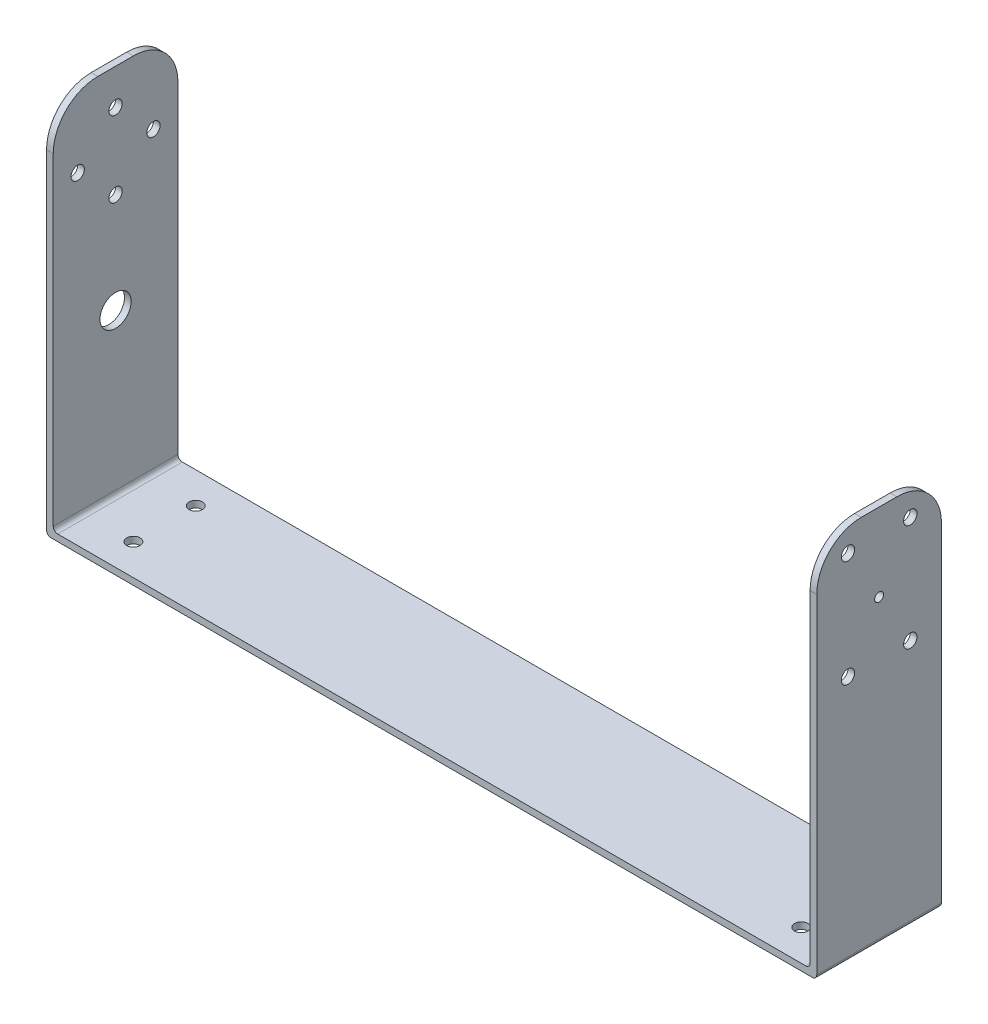
ISO-10303-21;
HEADER;
FILE_DESCRIPTION(('STEP AP214'),'2;1');
FILE_NAME('part.step','',(''),(''),'','','');
FILE_SCHEMA(('AUTOMOTIVE_DESIGN { 1 0 10303 214 1 1 1 1 }'));
ENDSEC;
DATA;
#1=APPLICATION_CONTEXT('core data for automotive mechanical design processes');
#2=APPLICATION_PROTOCOL_DEFINITION('international standard','automotive_design',2000,#1);
#3=PRODUCT_CONTEXT('',#1,'mechanical');
#4=PRODUCT('Part','Part','',(#3));
#5=PRODUCT_RELATED_PRODUCT_CATEGORY('part','',(#4));
#6=PRODUCT_DEFINITION_FORMATION('','',#4);
#7=PRODUCT_DEFINITION_CONTEXT('part definition',#1,'design');
#8=PRODUCT_DEFINITION('design','',#6,#7);
#9=PRODUCT_DEFINITION_SHAPE('','',#8);
#10=(LENGTH_UNIT() NAMED_UNIT(*) SI_UNIT(.MILLI.,.METRE.));
#11=(NAMED_UNIT(*) PLANE_ANGLE_UNIT() SI_UNIT($,.RADIAN.));
#12=(NAMED_UNIT(*) SI_UNIT($,.STERADIAN.) SOLID_ANGLE_UNIT());
#13=UNCERTAINTY_MEASURE_WITH_UNIT(LENGTH_MEASURE(1.E-05),#10,'distance_accuracy_value','');
#14=(GEOMETRIC_REPRESENTATION_CONTEXT(3) GLOBAL_UNCERTAINTY_ASSIGNED_CONTEXT((#13)) GLOBAL_UNIT_ASSIGNED_CONTEXT((#10,
#11,#12)) REPRESENTATION_CONTEXT('',''));
#15=CARTESIAN_POINT('',(0.,0.,0.));
#16=DIRECTION('',(0.,0.,1.));
#17=DIRECTION('',(1.,0.,0.));
#18=AXIS2_PLACEMENT_3D('',#15,#16,#17);
#19=CARTESIAN_POINT('',(171.5,0.,0.));
#20=DIRECTION('',(1.,0.,0.));
#21=DIRECTION('',(0.,0.,-1.));
#22=AXIS2_PLACEMENT_3D('',#19,#20,#21);
#23=PLANE('',#22);
#24=CARTESIAN_POINT('',(171.5,55.5,-7.));
#25=DIRECTION('',(1.,0.,0.));
#26=DIRECTION('',(0.,0.,-1.));
#27=AXIS2_PLACEMENT_3D('',#24,#25,#26);
#28=CIRCLE('',#27,1.5);
#29=CARTESIAN_POINT('',(171.5,55.5,-8.5));
#30=VERTEX_POINT('',#29);
#31=EDGE_CURVE('E285',#30,#30,#28,.F.);
#32=ORIENTED_EDGE('',*,*,#31,.T.);
#33=EDGE_LOOP('',(#32));
#34=FACE_BOUND('',#33,.T.);
#35=CARTESIAN_POINT('',(171.5,79.5,-21.));
#36=DIRECTION('',(1.,0.,0.));
#37=DIRECTION('',(0.,0.,-1.));
#38=AXIS2_PLACEMENT_3D('',#35,#36,#37);
#39=CIRCLE('',#38,1.5);
#40=CARTESIAN_POINT('',(171.5,79.5,-22.5));
#41=VERTEX_POINT('',#40);
#42=EDGE_CURVE('E281',#41,#41,#39,.F.);
#43=ORIENTED_EDGE('',*,*,#42,.T.);
#44=EDGE_LOOP('',(#43));
#45=FACE_BOUND('',#44,.T.);
#46=DIRECTION('',(0.,1.,0.));
#47=VECTOR('',#46,1.);
#48=CARTESIAN_POINT('',(171.5,0.,-28.));
#49=LINE('',#48,#47);
#50=CARTESIAN_POINT('',(171.5,1.,-28.));
#51=VERTEX_POINT('',#50);
#52=CARTESIAN_POINT('',(171.5,75.,-28.));
#53=VERTEX_POINT('',#52);
#54=EDGE_CURVE('E259',#51,#53,#49,.T.);
#55=ORIENTED_EDGE('',*,*,#54,.T.);
#56=CARTESIAN_POINT('',(171.5,75.,-18.));
#57=DIRECTION('',(1.,0.,0.));
#58=DIRECTION('',(0.,0.,-1.));
#59=AXIS2_PLACEMENT_3D('',#56,#57,#58);
#60=CIRCLE('',#59,10.);
#61=CARTESIAN_POINT('',(171.5,85.,-18.));
#62=VERTEX_POINT('',#61);
#63=EDGE_CURVE('E11',#53,#62,#60,.T.);
#64=ORIENTED_EDGE('',*,*,#63,.T.);
#65=DIRECTION('',(0.,0.,1.));
#66=VECTOR('',#65,1.);
#67=CARTESIAN_POINT('',(171.5,85.,-28.));
#68=LINE('',#67,#66);
#69=CARTESIAN_POINT('',(171.5,85.,-10.));
#70=VERTEX_POINT('',#69);
#71=EDGE_CURVE('E311',#62,#70,#68,.T.);
#72=ORIENTED_EDGE('',*,*,#71,.T.);
#73=CARTESIAN_POINT('',(171.5,75.,-10.));
#74=DIRECTION('',(1.,0.,0.));
#75=DIRECTION('',(0.,0.,-1.));
#76=AXIS2_PLACEMENT_3D('',#73,#74,#75);
#77=CIRCLE('',#76,10.);
#78=CARTESIAN_POINT('',(171.5,75.,0.));
#79=VERTEX_POINT('',#78);
#80=EDGE_CURVE('E271',#70,#79,#77,.T.);
#81=ORIENTED_EDGE('',*,*,#80,.T.);
#82=DIRECTION('',(0.,-1.,0.));
#83=VECTOR('',#82,1.);
#84=CARTESIAN_POINT('',(171.5,0.,0.));
#85=LINE('',#84,#83);
#86=CARTESIAN_POINT('',(171.5,1.,0.));
#87=VERTEX_POINT('',#86);
#88=EDGE_CURVE('E313',#79,#87,#85,.T.);
#89=ORIENTED_EDGE('',*,*,#88,.T.);
#90=DIRECTION('',(0.,0.,-1.));
#91=VECTOR('',#90,1.);
#92=CARTESIAN_POINT('',(171.5,1.,0.));
#93=LINE('',#92,#91);
#94=EDGE_CURVE('E326',#87,#51,#93,.T.);
#95=ORIENTED_EDGE('',*,*,#94,.T.);
#96=EDGE_LOOP('',(#55,#64,#72,#81,#89,#95));
#97=FACE_BOUND('',#96,.T.);
#98=CARTESIAN_POINT('',(171.5,67.5,-14.));
#99=DIRECTION('',(1.,0.,0.));
#100=DIRECTION('',(0.,0.,-1.));
#101=AXIS2_PLACEMENT_3D('',#98,#99,#100);
#102=CIRCLE('',#101,1.);
#103=CARTESIAN_POINT('',(171.5,67.5,-15.));
#104=VERTEX_POINT('',#103);
#105=EDGE_CURVE('E304',#104,#104,#102,.T.);
#106=ORIENTED_EDGE('',*,*,#105,.F.);
#107=EDGE_LOOP('',(#106));
#108=FACE_BOUND('',#107,.T.);
#109=CARTESIAN_POINT('',(171.5,79.5,-7.));
#110=DIRECTION('',(1.,0.,0.));
#111=DIRECTION('',(0.,0.,-1.));
#112=AXIS2_PLACEMENT_3D('',#109,#110,#111);
#113=CIRCLE('',#112,1.5);
#114=CARTESIAN_POINT('',(171.5,79.5,-8.5));
#115=VERTEX_POINT('',#114);
#116=EDGE_CURVE('E282',#115,#115,#113,.F.);
#117=ORIENTED_EDGE('',*,*,#116,.T.);
#118=EDGE_LOOP('',(#117));
#119=FACE_BOUND('',#118,.T.);
#120=CARTESIAN_POINT('',(171.5,55.5,-21.));
#121=DIRECTION('',(1.,0.,0.));
#122=DIRECTION('',(0.,0.,-1.));
#123=AXIS2_PLACEMENT_3D('',#120,#121,#122);
#124=CIRCLE('',#123,1.5);
#125=CARTESIAN_POINT('',(171.5,55.5,-22.5));
#126=VERTEX_POINT('',#125);
#127=EDGE_CURVE('E288',#126,#126,#124,.F.);
#128=ORIENTED_EDGE('',*,*,#127,.T.);
#129=EDGE_LOOP('',(#128));
#130=FACE_BOUND('',#129,.T.);
#131=ADVANCED_FACE('F32',(#34,#45,#97,#108,#119,#130),#23,.T.);
#132=CARTESIAN_POINT('',(170.,0.,0.));
#133=DIRECTION('',(1.,0.,0.));
#134=DIRECTION('',(0.,0.,-1.));
#135=AXIS2_PLACEMENT_3D('',#132,#133,#134);
#136=PLANE('',#135);
#137=CARTESIAN_POINT('',(170.,55.5,-7.));
#138=DIRECTION('',(1.,0.,0.));
#139=DIRECTION('',(0.,0.,-1.));
#140=AXIS2_PLACEMENT_3D('',#137,#138,#139);
#141=CIRCLE('',#140,1.5);
#142=CARTESIAN_POINT('',(170.,55.5,-8.5));
#143=VERTEX_POINT('',#142);
#144=EDGE_CURVE('E286',#143,#143,#141,.F.);
#145=ORIENTED_EDGE('',*,*,#144,.F.);
#146=EDGE_LOOP('',(#145));
#147=FACE_BOUND('',#146,.T.);
#148=CARTESIAN_POINT('',(170.,79.5,-21.));
#149=DIRECTION('',(1.,0.,0.));
#150=DIRECTION('',(0.,0.,-1.));
#151=AXIS2_PLACEMENT_3D('',#148,#149,#150);
#152=CIRCLE('',#151,1.5);
#153=CARTESIAN_POINT('',(170.,79.5,-22.5));
#154=VERTEX_POINT('',#153);
#155=EDGE_CURVE('E278',#154,#154,#152,.F.);
#156=ORIENTED_EDGE('',*,*,#155,.F.);
#157=EDGE_LOOP('',(#156));
#158=FACE_BOUND('',#157,.T.);
#159=DIRECTION('',(0.,0.,1.));
#160=VECTOR('',#159,1.);
#161=CARTESIAN_POINT('',(170.,85.,-28.));
#162=LINE('',#161,#160);
#163=CARTESIAN_POINT('',(170.,85.,-18.));
#164=VERTEX_POINT('',#163);
#165=CARTESIAN_POINT('',(170.,85.,-10.));
#166=VERTEX_POINT('',#165);
#167=EDGE_CURVE('E253',#164,#166,#162,.T.);
#168=ORIENTED_EDGE('',*,*,#167,.F.);
#169=CARTESIAN_POINT('',(170.,75.,-18.));
#170=DIRECTION('',(1.,0.,0.));
#171=DIRECTION('',(0.,0.,-1.));
#172=AXIS2_PLACEMENT_3D('',#169,#170,#171);
#173=CIRCLE('',#172,10.);
#174=CARTESIAN_POINT('',(170.,75.,-28.));
#175=VERTEX_POINT('',#174);
#176=EDGE_CURVE('E56',#164,#175,#173,.F.);
#177=ORIENTED_EDGE('',*,*,#176,.T.);
#178=DIRECTION('',(0.,1.,0.));
#179=VECTOR('',#178,1.);
#180=CARTESIAN_POINT('',(170.,0.,-28.));
#181=LINE('',#180,#179);
#182=CARTESIAN_POINT('',(170.,2.5,-28.));
#183=VERTEX_POINT('',#182);
#184=EDGE_CURVE('E307',#183,#175,#181,.T.);
#185=ORIENTED_EDGE('',*,*,#184,.F.);
#186=DIRECTION('',(0.,0.,-1.));
#187=VECTOR('',#186,1.);
#188=CARTESIAN_POINT('',(170.,2.5,0.));
#189=LINE('',#188,#187);
#190=CARTESIAN_POINT('',(170.,2.5,0.));
#191=VERTEX_POINT('',#190);
#192=EDGE_CURVE('E319',#183,#191,#189,.F.);
#193=ORIENTED_EDGE('',*,*,#192,.T.);
#194=DIRECTION('',(0.,-1.,0.));
#195=VECTOR('',#194,1.);
#196=CARTESIAN_POINT('',(170.,0.,0.));
#197=LINE('',#196,#195);
#198=CARTESIAN_POINT('',(170.,75.,0.));
#199=VERTEX_POINT('',#198);
#200=EDGE_CURVE('E256',#199,#191,#197,.T.);
#201=ORIENTED_EDGE('',*,*,#200,.F.);
#202=CARTESIAN_POINT('',(170.,75.,-10.));
#203=DIRECTION('',(1.,0.,0.));
#204=DIRECTION('',(0.,0.,-1.));
#205=AXIS2_PLACEMENT_3D('',#202,#203,#204);
#206=CIRCLE('',#205,10.);
#207=EDGE_CURVE('E265',#199,#166,#206,.F.);
#208=ORIENTED_EDGE('',*,*,#207,.T.);
#209=EDGE_LOOP('',(#168,#177,#185,#193,#201,#208));
#210=FACE_BOUND('',#209,.T.);
#211=CARTESIAN_POINT('',(170.,67.5,-14.));
#212=DIRECTION('',(1.,0.,0.));
#213=DIRECTION('',(0.,0.,-1.));
#214=AXIS2_PLACEMENT_3D('',#211,#212,#213);
#215=CIRCLE('',#214,1.);
#216=CARTESIAN_POINT('',(170.,67.5,-15.));
#217=VERTEX_POINT('',#216);
#218=EDGE_CURVE('E303',#217,#217,#215,.T.);
#219=ORIENTED_EDGE('',*,*,#218,.T.);
#220=EDGE_LOOP('',(#219));
#221=FACE_BOUND('',#220,.T.);
#222=CARTESIAN_POINT('',(170.,79.5,-7.));
#223=DIRECTION('',(1.,0.,0.));
#224=DIRECTION('',(0.,0.,-1.));
#225=AXIS2_PLACEMENT_3D('',#222,#223,#224);
#226=CIRCLE('',#225,1.5);
#227=CARTESIAN_POINT('',(170.,79.5,-8.5));
#228=VERTEX_POINT('',#227);
#229=EDGE_CURVE('E283',#228,#228,#226,.F.);
#230=ORIENTED_EDGE('',*,*,#229,.F.);
#231=EDGE_LOOP('',(#230));
#232=FACE_BOUND('',#231,.T.);
#233=CARTESIAN_POINT('',(170.,55.5,-21.));
#234=DIRECTION('',(1.,0.,0.));
#235=DIRECTION('',(0.,0.,-1.));
#236=AXIS2_PLACEMENT_3D('',#233,#234,#235);
#237=CIRCLE('',#236,1.5);
#238=CARTESIAN_POINT('',(170.,55.5,-22.5));
#239=VERTEX_POINT('',#238);
#240=EDGE_CURVE('E36',#239,#239,#237,.F.);
#241=ORIENTED_EDGE('',*,*,#240,.F.);
#242=EDGE_LOOP('',(#241));
#243=FACE_BOUND('',#242,.T.);
#244=ADVANCED_FACE('F374',(#147,#158,#210,#221,#232,#243),#136,.F.);
#245=CARTESIAN_POINT('',(0.,1.5,0.));
#246=DIRECTION('',(0.,-1.,0.));
#247=DIRECTION('',(0.,0.,-1.));
#248=AXIS2_PLACEMENT_3D('',#245,#246,#247);
#249=PLANE('',#248);
#250=CARTESIAN_POINT('',(11.,1.5,-7.));
#251=DIRECTION('',(0.,-1.,0.));
#252=DIRECTION('',(0.,0.,-1.));
#253=AXIS2_PLACEMENT_3D('',#250,#251,#252);
#254=CIRCLE('',#253,1.5);
#255=CARTESIAN_POINT('',(11.,1.5,-8.5));
#256=VERTEX_POINT('',#255);
#257=EDGE_CURVE('E243',#256,#256,#254,.F.);
#258=ORIENTED_EDGE('',*,*,#257,.F.);
#259=EDGE_LOOP('',(#258));
#260=FACE_BOUND('',#259,.T.);
#261=CARTESIAN_POINT('',(161.,1.5,-7.));
#262=DIRECTION('',(0.,-1.,0.));
#263=DIRECTION('',(0.,0.,-1.));
#264=AXIS2_PLACEMENT_3D('',#261,#262,#263);
#265=CIRCLE('',#264,1.5);
#266=CARTESIAN_POINT('',(161.,1.5,-8.5));
#267=VERTEX_POINT('',#266);
#268=EDGE_CURVE('E235',#267,#267,#265,.F.);
#269=ORIENTED_EDGE('',*,*,#268,.F.);
#270=EDGE_LOOP('',(#269));
#271=FACE_BOUND('',#270,.T.);
#272=DIRECTION('',(1.,0.,0.));
#273=VECTOR('',#272,1.);
#274=CARTESIAN_POINT('',(0.,1.5,0.));
#275=LINE('',#274,#273);
#276=CARTESIAN_POINT('',(1.,1.5,0.));
#277=VERTEX_POINT('',#276);
#278=CARTESIAN_POINT('',(169.,1.5,0.));
#279=VERTEX_POINT('',#278);
#280=EDGE_CURVE('E177',#277,#279,#275,.T.);
#281=ORIENTED_EDGE('',*,*,#280,.T.);
#282=DIRECTION('',(0.,0.,-1.));
#283=VECTOR('',#282,1.);
#284=CARTESIAN_POINT('',(169.,1.5,-28.));
#285=LINE('',#284,#283);
#286=CARTESIAN_POINT('',(169.,1.5,-28.));
#287=VERTEX_POINT('',#286);
#288=EDGE_CURVE('E318',#279,#287,#285,.T.);
#289=ORIENTED_EDGE('',*,*,#288,.T.);
#290=DIRECTION('',(-1.,0.,0.));
#291=VECTOR('',#290,1.);
#292=CARTESIAN_POINT('',(0.,1.5,-28.));
#293=LINE('',#292,#291);
#294=CARTESIAN_POINT('',(1.,1.5,-28.));
#295=VERTEX_POINT('',#294);
#296=EDGE_CURVE('E174',#287,#295,#293,.T.);
#297=ORIENTED_EDGE('',*,*,#296,.T.);
#298=DIRECTION('',(0.,0.,1.));
#299=VECTOR('',#298,1.);
#300=CARTESIAN_POINT('',(1.,1.5,0.));
#301=LINE('',#300,#299);
#302=EDGE_CURVE('E203',#295,#277,#301,.T.);
#303=ORIENTED_EDGE('',*,*,#302,.T.);
#304=EDGE_LOOP('',(#281,#289,#297,#303));
#305=FACE_BOUND('',#304,.T.);
#306=CARTESIAN_POINT('',(11.,1.5,-21.));
#307=DIRECTION('',(0.,-1.,0.));
#308=DIRECTION('',(0.,0.,-1.));
#309=AXIS2_PLACEMENT_3D('',#306,#307,#308);
#310=CIRCLE('',#309,1.5);
#311=CARTESIAN_POINT('',(11.,1.5,-22.5));
#312=VERTEX_POINT('',#311);
#313=EDGE_CURVE('E239',#312,#312,#310,.F.);
#314=ORIENTED_EDGE('',*,*,#313,.F.);
#315=EDGE_LOOP('',(#314));
#316=FACE_BOUND('',#315,.T.);
#317=CARTESIAN_POINT('',(161.,1.5,-21.));
#318=DIRECTION('',(0.,-1.,0.));
#319=DIRECTION('',(0.,0.,-1.));
#320=AXIS2_PLACEMENT_3D('',#317,#318,#319);
#321=CIRCLE('',#320,1.5);
#322=CARTESIAN_POINT('',(161.,1.5,-22.5));
#323=VERTEX_POINT('',#322);
#324=EDGE_CURVE('E247',#323,#323,#321,.F.);
#325=ORIENTED_EDGE('',*,*,#324,.F.);
#326=EDGE_LOOP('',(#325));
#327=FACE_BOUND('',#326,.T.);
#328=ADVANCED_FACE('F381',(#260,#271,#305,#316,#327),#249,.F.);
#329=CARTESIAN_POINT('',(0.,0.,0.));
#330=DIRECTION('',(0.,-1.,0.));
#331=DIRECTION('',(0.,0.,-1.));
#332=AXIS2_PLACEMENT_3D('',#329,#330,#331);
#333=PLANE('',#332);
#334=CARTESIAN_POINT('',(11.,0.,-7.));
#335=DIRECTION('',(0.,-1.,0.));
#336=DIRECTION('',(0.,0.,-1.));
#337=AXIS2_PLACEMENT_3D('',#334,#335,#336);
#338=CIRCLE('',#337,1.5);
#339=CARTESIAN_POINT('',(11.,0.,-8.5));
#340=VERTEX_POINT('',#339);
#341=EDGE_CURVE('E246',#340,#340,#338,.F.);
#342=ORIENTED_EDGE('',*,*,#341,.T.);
#343=EDGE_LOOP('',(#342));
#344=FACE_BOUND('',#343,.T.);
#345=CARTESIAN_POINT('',(161.,0.,-7.));
#346=DIRECTION('',(0.,-1.,0.));
#347=DIRECTION('',(0.,0.,-1.));
#348=AXIS2_PLACEMENT_3D('',#345,#346,#347);
#349=CIRCLE('',#348,1.5);
#350=CARTESIAN_POINT('',(161.,0.,-8.5));
#351=VERTEX_POINT('',#350);
#352=EDGE_CURVE('E238',#351,#351,#349,.F.);
#353=ORIENTED_EDGE('',*,*,#352,.T.);
#354=EDGE_LOOP('',(#353));
#355=FACE_BOUND('',#354,.T.);
#356=DIRECTION('',(-1.,0.,0.));
#357=VECTOR('',#356,1.);
#358=CARTESIAN_POINT('',(0.,0.,-28.));
#359=LINE('',#358,#357);
#360=CARTESIAN_POINT('',(170.5,0.,-28.));
#361=VERTEX_POINT('',#360);
#362=CARTESIAN_POINT('',(-0.5,0.,-28.));
#363=VERTEX_POINT('',#362);
#364=EDGE_CURVE('E194',#361,#363,#359,.T.);
#365=ORIENTED_EDGE('',*,*,#364,.F.);
#366=DIRECTION('',(0.,0.,-1.));
#367=VECTOR('',#366,1.);
#368=CARTESIAN_POINT('',(170.5,0.,0.));
#369=LINE('',#368,#367);
#370=CARTESIAN_POINT('',(170.5,0.,0.));
#371=VERTEX_POINT('',#370);
#372=EDGE_CURVE('E330',#361,#371,#369,.F.);
#373=ORIENTED_EDGE('',*,*,#372,.T.);
#374=DIRECTION('',(1.,0.,0.));
#375=VECTOR('',#374,1.);
#376=CARTESIAN_POINT('',(0.,0.,0.));
#377=LINE('',#376,#375);
#378=CARTESIAN_POINT('',(-0.5,0.,0.));
#379=VERTEX_POINT('',#378);
#380=EDGE_CURVE('E191',#379,#371,#377,.T.);
#381=ORIENTED_EDGE('',*,*,#380,.F.);
#382=DIRECTION('',(0.,0.,-1.));
#383=VECTOR('',#382,1.);
#384=CARTESIAN_POINT('',(-0.5,0.,-28.));
#385=LINE('',#384,#383);
#386=EDGE_CURVE('E351',#379,#363,#385,.T.);
#387=ORIENTED_EDGE('',*,*,#386,.T.);
#388=EDGE_LOOP('',(#365,#373,#381,#387));
#389=FACE_BOUND('',#388,.T.);
#390=CARTESIAN_POINT('',(11.,0.,-21.));
#391=DIRECTION('',(0.,-1.,0.));
#392=DIRECTION('',(0.,0.,-1.));
#393=AXIS2_PLACEMENT_3D('',#390,#391,#392);
#394=CIRCLE('',#393,1.5);
#395=CARTESIAN_POINT('',(11.,0.,-22.5));
#396=VERTEX_POINT('',#395);
#397=EDGE_CURVE('E242',#396,#396,#394,.F.);
#398=ORIENTED_EDGE('',*,*,#397,.T.);
#399=EDGE_LOOP('',(#398));
#400=FACE_BOUND('',#399,.T.);
#401=CARTESIAN_POINT('',(161.,0.,-21.));
#402=DIRECTION('',(0.,-1.,0.));
#403=DIRECTION('',(0.,0.,-1.));
#404=AXIS2_PLACEMENT_3D('',#401,#402,#403);
#405=CIRCLE('',#404,1.5);
#406=CARTESIAN_POINT('',(161.,0.,-22.5));
#407=VERTEX_POINT('',#406);
#408=EDGE_CURVE('E250',#407,#407,#405,.F.);
#409=ORIENTED_EDGE('',*,*,#408,.T.);
#410=EDGE_LOOP('',(#409));
#411=FACE_BOUND('',#410,.T.);
#412=ADVANCED_FACE('F348',(#344,#355,#389,#400,#411),#333,.T.);
#413=CARTESIAN_POINT('',(0.,0.,0.));
#414=DIRECTION('',(1.,0.,0.));
#415=DIRECTION('',(0.,0.,-1.));
#416=AXIS2_PLACEMENT_3D('',#413,#414,#415);
#417=PLANE('',#416);
#418=CARTESIAN_POINT('',(0.,68.5,-5.5));
#419=DIRECTION('',(1.,0.,0.));
#420=DIRECTION('',(0.,0.,-1.));
#421=AXIS2_PLACEMENT_3D('',#418,#419,#420);
#422=CIRCLE('',#421,1.5);
#423=CARTESIAN_POINT('',(0.,68.5,-7.));
#424=VERTEX_POINT('',#423);
#425=EDGE_CURVE('E227',#424,#424,#422,.F.);
#426=ORIENTED_EDGE('',*,*,#425,.T.);
#427=EDGE_LOOP('',(#426));
#428=FACE_BOUND('',#427,.T.);
#429=CARTESIAN_POINT('',(0.,60.,-14.));
#430=DIRECTION('',(1.,0.,0.));
#431=DIRECTION('',(0.,0.,-1.));
#432=AXIS2_PLACEMENT_3D('',#429,#430,#431);
#433=CIRCLE('',#432,1.5);
#434=CARTESIAN_POINT('',(0.,60.,-15.5));
#435=VERTEX_POINT('',#434);
#436=EDGE_CURVE('E219',#435,#435,#433,.F.);
#437=ORIENTED_EDGE('',*,*,#436,.T.);
#438=EDGE_LOOP('',(#437));
#439=FACE_BOUND('',#438,.T.);
#440=DIRECTION('',(0.,-1.,0.));
#441=VECTOR('',#440,1.);
#442=CARTESIAN_POINT('',(0.,0.,0.));
#443=LINE('',#442,#441);
#444=CARTESIAN_POINT('',(0.,75.,0.));
#445=VERTEX_POINT('',#444);
#446=CARTESIAN_POINT('',(0.,2.5,0.));
#447=VERTEX_POINT('',#446);
#448=EDGE_CURVE('E157',#445,#447,#443,.T.);
#449=ORIENTED_EDGE('',*,*,#448,.T.);
#450=DIRECTION('',(0.,0.,1.));
#451=VECTOR('',#450,1.);
#452=CARTESIAN_POINT('',(0.,2.5,0.));
#453=LINE('',#452,#451);
#454=CARTESIAN_POINT('',(0.,2.5,-28.));
#455=VERTEX_POINT('',#454);
#456=EDGE_CURVE('E206',#447,#455,#453,.F.);
#457=ORIENTED_EDGE('',*,*,#456,.T.);
#458=DIRECTION('',(0.,1.,0.));
#459=VECTOR('',#458,1.);
#460=CARTESIAN_POINT('',(0.,0.,-28.));
#461=LINE('',#460,#459);
#462=CARTESIAN_POINT('',(0.,75.,-28.));
#463=VERTEX_POINT('',#462);
#464=EDGE_CURVE('E207',#455,#463,#461,.T.);
#465=ORIENTED_EDGE('',*,*,#464,.T.);
#466=CARTESIAN_POINT('',(0.,75.,-18.));
#467=DIRECTION('',(1.,0.,0.));
#468=DIRECTION('',(0.,0.,-1.));
#469=AXIS2_PLACEMENT_3D('',#466,#467,#468);
#470=CIRCLE('',#469,10.);
#471=CARTESIAN_POINT('',(0.,85.,-18.));
#472=VERTEX_POINT('',#471);
#473=EDGE_CURVE('E172',#463,#472,#470,.T.);
#474=ORIENTED_EDGE('',*,*,#473,.T.);
#475=DIRECTION('',(0.,0.,1.));
#476=VECTOR('',#475,1.);
#477=CARTESIAN_POINT('',(0.,85.,-28.));
#478=LINE('',#477,#476);
#479=CARTESIAN_POINT('',(0.,85.,-10.));
#480=VERTEX_POINT('',#479);
#481=EDGE_CURVE('E185',#472,#480,#478,.T.);
#482=ORIENTED_EDGE('',*,*,#481,.T.);
#483=CARTESIAN_POINT('',(0.,75.,-10.));
#484=DIRECTION('',(1.,0.,0.));
#485=DIRECTION('',(0.,0.,-1.));
#486=AXIS2_PLACEMENT_3D('',#483,#484,#485);
#487=CIRCLE('',#486,10.);
#488=EDGE_CURVE('E173',#480,#445,#487,.T.);
#489=ORIENTED_EDGE('',*,*,#488,.T.);
#490=EDGE_LOOP('',(#449,#457,#465,#474,#482,#489));
#491=FACE_BOUND('',#490,.T.);
#492=CARTESIAN_POINT('',(0.,77.,-14.));
#493=DIRECTION('',(1.,0.,0.));
#494=DIRECTION('',(0.,0.,-1.));
#495=AXIS2_PLACEMENT_3D('',#492,#493,#494);
#496=CIRCLE('',#495,1.5);
#497=CARTESIAN_POINT('',(0.,77.,-15.5));
#498=VERTEX_POINT('',#497);
#499=EDGE_CURVE('E209',#498,#498,#496,.F.);
#500=ORIENTED_EDGE('',*,*,#499,.T.);
#501=EDGE_LOOP('',(#500));
#502=FACE_BOUND('',#501,.T.);
#503=CARTESIAN_POINT('',(0.,68.5,-22.5));
#504=DIRECTION('',(1.,0.,0.));
#505=DIRECTION('',(0.,0.,-1.));
#506=AXIS2_PLACEMENT_3D('',#503,#504,#505);
#507=CIRCLE('',#506,1.5);
#508=CARTESIAN_POINT('',(0.,68.5,-24.));
#509=VERTEX_POINT('',#508);
#510=EDGE_CURVE('E223',#509,#509,#507,.F.);
#511=ORIENTED_EDGE('',*,*,#510,.T.);
#512=EDGE_LOOP('',(#511));
#513=FACE_BOUND('',#512,.T.);
#514=CARTESIAN_POINT('',(0.,37.5,-14.));
#515=DIRECTION('',(1.,0.,0.));
#516=DIRECTION('',(0.,0.,-1.));
#517=AXIS2_PLACEMENT_3D('',#514,#515,#516);
#518=CIRCLE('',#517,3.5);
#519=CARTESIAN_POINT('',(0.,37.5,-17.5));
#520=VERTEX_POINT('',#519);
#521=EDGE_CURVE('E231',#520,#520,#518,.F.);
#522=ORIENTED_EDGE('',*,*,#521,.T.);
#523=EDGE_LOOP('',(#522));
#524=FACE_BOUND('',#523,.T.);
#525=ADVANCED_FACE('F430',(#428,#439,#491,#502,#513,#524),#417,.T.);
#526=CARTESIAN_POINT('',(-1.5,0.,0.));
#527=DIRECTION('',(1.,0.,0.));
#528=DIRECTION('',(0.,0.,-1.));
#529=AXIS2_PLACEMENT_3D('',#526,#527,#528);
#530=PLANE('',#529);
#531=CARTESIAN_POINT('',(-1.5,68.5,-5.5));
#532=DIRECTION('',(1.,0.,0.));
#533=DIRECTION('',(0.,0.,-1.));
#534=AXIS2_PLACEMENT_3D('',#531,#532,#533);
#535=CIRCLE('',#534,1.5);
#536=CARTESIAN_POINT('',(-1.5,68.5,-7.));
#537=VERTEX_POINT('',#536);
#538=EDGE_CURVE('E230',#537,#537,#535,.F.);
#539=ORIENTED_EDGE('',*,*,#538,.F.);
#540=EDGE_LOOP('',(#539));
#541=FACE_BOUND('',#540,.T.);
#542=CARTESIAN_POINT('',(-1.5,60.,-14.));
#543=DIRECTION('',(1.,0.,0.));
#544=DIRECTION('',(0.,0.,-1.));
#545=AXIS2_PLACEMENT_3D('',#542,#543,#544);
#546=CIRCLE('',#545,1.5);
#547=CARTESIAN_POINT('',(-1.5,60.,-15.5));
#548=VERTEX_POINT('',#547);
#549=EDGE_CURVE('E222',#548,#548,#546,.F.);
#550=ORIENTED_EDGE('',*,*,#549,.F.);
#551=EDGE_LOOP('',(#550));
#552=FACE_BOUND('',#551,.T.);
#553=DIRECTION('',(0.,1.,0.));
#554=VECTOR('',#553,1.);
#555=CARTESIAN_POINT('',(-1.5,0.,-28.));
#556=LINE('',#555,#554);
#557=CARTESIAN_POINT('',(-1.5,1.,-28.));
#558=VERTEX_POINT('',#557);
#559=CARTESIAN_POINT('',(-1.5,75.,-28.));
#560=VERTEX_POINT('',#559);
#561=EDGE_CURVE('E146',#558,#560,#556,.T.);
#562=ORIENTED_EDGE('',*,*,#561,.F.);
#563=DIRECTION('',(0.,0.,-1.));
#564=VECTOR('',#563,1.);
#565=CARTESIAN_POINT('',(-1.5,1.,0.));
#566=LINE('',#565,#564);
#567=CARTESIAN_POINT('',(-1.5,1.,0.));
#568=VERTEX_POINT('',#567);
#569=EDGE_CURVE('E355',#558,#568,#566,.F.);
#570=ORIENTED_EDGE('',*,*,#569,.T.);
#571=DIRECTION('',(0.,-1.,0.));
#572=VECTOR('',#571,1.);
#573=CARTESIAN_POINT('',(-1.5,0.,0.));
#574=LINE('',#573,#572);
#575=CARTESIAN_POINT('',(-1.5,75.,0.));
#576=VERTEX_POINT('',#575);
#577=EDGE_CURVE('E195',#576,#568,#574,.T.);
#578=ORIENTED_EDGE('',*,*,#577,.F.);
#579=CARTESIAN_POINT('',(-1.5,75.,-10.));
#580=DIRECTION('',(1.,0.,0.));
#581=DIRECTION('',(0.,0.,-1.));
#582=AXIS2_PLACEMENT_3D('',#579,#580,#581);
#583=CIRCLE('',#582,10.);
#584=CARTESIAN_POINT('',(-1.5,85.,-10.));
#585=VERTEX_POINT('',#584);
#586=EDGE_CURVE('E168',#576,#585,#583,.F.);
#587=ORIENTED_EDGE('',*,*,#586,.T.);
#588=DIRECTION('',(0.,0.,1.));
#589=VECTOR('',#588,1.);
#590=CARTESIAN_POINT('',(-1.5,85.,-28.));
#591=LINE('',#590,#589);
#592=CARTESIAN_POINT('',(-1.5,85.,-18.));
#593=VERTEX_POINT('',#592);
#594=EDGE_CURVE('E156',#593,#585,#591,.T.);
#595=ORIENTED_EDGE('',*,*,#594,.F.);
#596=CARTESIAN_POINT('',(-1.5,75.,-18.));
#597=DIRECTION('',(1.,0.,0.));
#598=DIRECTION('',(0.,0.,-1.));
#599=AXIS2_PLACEMENT_3D('',#596,#597,#598);
#600=CIRCLE('',#599,10.);
#601=EDGE_CURVE('E161',#593,#560,#600,.F.);
#602=ORIENTED_EDGE('',*,*,#601,.T.);
#603=EDGE_LOOP('',(#562,#570,#578,#587,#595,#602));
#604=FACE_BOUND('',#603,.T.);
#605=CARTESIAN_POINT('',(-1.5,77.,-14.));
#606=DIRECTION('',(1.,0.,0.));
#607=DIRECTION('',(0.,0.,-1.));
#608=AXIS2_PLACEMENT_3D('',#605,#606,#607);
#609=CIRCLE('',#608,1.5);
#610=CARTESIAN_POINT('',(-1.5,77.,-15.5));
#611=VERTEX_POINT('',#610);
#612=EDGE_CURVE('E218',#611,#611,#609,.F.);
#613=ORIENTED_EDGE('',*,*,#612,.F.);
#614=EDGE_LOOP('',(#613));
#615=FACE_BOUND('',#614,.T.);
#616=CARTESIAN_POINT('',(-1.5,68.5,-22.5));
#617=DIRECTION('',(1.,0.,0.));
#618=DIRECTION('',(0.,0.,-1.));
#619=AXIS2_PLACEMENT_3D('',#616,#617,#618);
#620=CIRCLE('',#619,1.5);
#621=CARTESIAN_POINT('',(-1.5,68.5,-24.));
#622=VERTEX_POINT('',#621);
#623=EDGE_CURVE('E226',#622,#622,#620,.F.);
#624=ORIENTED_EDGE('',*,*,#623,.F.);
#625=EDGE_LOOP('',(#624));
#626=FACE_BOUND('',#625,.T.);
#627=CARTESIAN_POINT('',(-1.5,37.5,-14.));
#628=DIRECTION('',(1.,0.,0.));
#629=DIRECTION('',(0.,0.,-1.));
#630=AXIS2_PLACEMENT_3D('',#627,#628,#629);
#631=CIRCLE('',#630,3.5);
#632=CARTESIAN_POINT('',(-1.5,37.5,-17.5));
#633=VERTEX_POINT('',#632);
#634=EDGE_CURVE('E234',#633,#633,#631,.F.);
#635=ORIENTED_EDGE('',*,*,#634,.F.);
#636=EDGE_LOOP('',(#635));
#637=FACE_BOUND('',#636,.T.);
#638=ADVANCED_FACE('F162',(#541,#552,#604,#615,#626,#637),#530,.F.);
#639=CARTESIAN_POINT('',(0.,1.5,0.));
#640=DIRECTION('',(0.,0.,-1.));
#641=DIRECTION('',(-1.,0.,0.));
#642=AXIS2_PLACEMENT_3D('',#639,#640,#641);
#643=PLANE('',#642);
#644=ORIENTED_EDGE('',*,*,#88,.F.);
#645=DIRECTION('',(-1.,0.,0.));
#646=VECTOR('',#645,1.);
#647=CARTESIAN_POINT('',(0.,75.,0.));
#648=LINE('',#647,#646);
#649=EDGE_CURVE('E262',#79,#199,#648,.T.);
#650=ORIENTED_EDGE('',*,*,#649,.T.);
#651=ORIENTED_EDGE('',*,*,#200,.T.);
#652=CARTESIAN_POINT('',(169.,2.5,0.));
#653=DIRECTION('',(0.,0.,-1.));
#654=DIRECTION('',(-1.,0.,0.));
#655=AXIS2_PLACEMENT_3D('',#652,#653,#654);
#656=CIRCLE('',#655,1.);
#657=EDGE_CURVE('E324',#191,#279,#656,.T.);
#658=ORIENTED_EDGE('',*,*,#657,.T.);
#659=ORIENTED_EDGE('',*,*,#280,.F.);
#660=CARTESIAN_POINT('',(1.,2.5,0.));
#661=DIRECTION('',(0.,0.,-1.));
#662=DIRECTION('',(-1.,0.,0.));
#663=AXIS2_PLACEMENT_3D('',#660,#661,#662);
#664=CIRCLE('',#663,1.);
#665=EDGE_CURVE('E697',#277,#447,#664,.T.);
#666=ORIENTED_EDGE('',*,*,#665,.T.);
#667=ORIENTED_EDGE('',*,*,#448,.F.);
#668=DIRECTION('',(1.,0.,0.));
#669=VECTOR('',#668,1.);
#670=CARTESIAN_POINT('',(-1.5,75.,0.));
#671=LINE('',#670,#669);
#672=EDGE_CURVE('E167',#445,#576,#671,.F.);
#673=ORIENTED_EDGE('',*,*,#672,.T.);
#674=ORIENTED_EDGE('',*,*,#577,.T.);
#675=CARTESIAN_POINT('',(-0.5,1.,0.));
#676=DIRECTION('',(0.,0.,-1.));
#677=DIRECTION('',(-1.,0.,0.));
#678=AXIS2_PLACEMENT_3D('',#675,#676,#677);
#679=CIRCLE('',#678,1.);
#680=EDGE_CURVE('E201',#568,#379,#679,.F.);
#681=ORIENTED_EDGE('',*,*,#680,.T.);
#682=ORIENTED_EDGE('',*,*,#380,.T.);
#683=CARTESIAN_POINT('',(170.5,1.,0.));
#684=DIRECTION('',(0.,0.,-1.));
#685=DIRECTION('',(-1.,0.,0.));
#686=AXIS2_PLACEMENT_3D('',#683,#684,#685);
#687=CIRCLE('',#686,1.);
#688=EDGE_CURVE('E260',#371,#87,#687,.F.);
#689=ORIENTED_EDGE('',*,*,#688,.T.);
#690=EDGE_LOOP('',(#644,#650,#651,#658,#659,#666,#667,#673,#674,#681,#682,#689));
#691=FACE_BOUND('',#690,.T.);
#692=ADVANCED_FACE('F340',(#691),#643,.F.);
#693=CARTESIAN_POINT('',(0.,1.5,-28.));
#694=DIRECTION('',(0.,0.,1.));
#695=DIRECTION('',(1.,0.,0.));
#696=AXIS2_PLACEMENT_3D('',#693,#694,#695);
#697=PLANE('',#696);
#698=ORIENTED_EDGE('',*,*,#184,.T.);
#699=DIRECTION('',(-1.,0.,0.));
#700=VECTOR('',#699,1.);
#701=CARTESIAN_POINT('',(0.,75.,-28.));
#702=LINE('',#701,#700);
#703=EDGE_CURVE('E41',#175,#53,#702,.F.);
#704=ORIENTED_EDGE('',*,*,#703,.T.);
#705=ORIENTED_EDGE('',*,*,#54,.F.);
#706=CARTESIAN_POINT('',(170.5,1.,-28.));
#707=DIRECTION('',(0.,0.,1.));
#708=DIRECTION('',(1.,0.,0.));
#709=AXIS2_PLACEMENT_3D('',#706,#707,#708);
#710=CIRCLE('',#709,1.);
#711=EDGE_CURVE('E329',#51,#361,#710,.F.);
#712=ORIENTED_EDGE('',*,*,#711,.T.);
#713=ORIENTED_EDGE('',*,*,#364,.T.);
#714=CARTESIAN_POINT('',(-0.5,1.,-28.));
#715=DIRECTION('',(0.,0.,1.));
#716=DIRECTION('',(1.,0.,0.));
#717=AXIS2_PLACEMENT_3D('',#714,#715,#716);
#718=CIRCLE('',#717,1.);
#719=EDGE_CURVE('E153',#363,#558,#718,.F.);
#720=ORIENTED_EDGE('',*,*,#719,.T.);
#721=ORIENTED_EDGE('',*,*,#561,.T.);
#722=DIRECTION('',(1.,0.,0.));
#723=VECTOR('',#722,1.);
#724=CARTESIAN_POINT('',(0.,75.,-28.));
#725=LINE('',#724,#723);
#726=EDGE_CURVE('E151',#560,#463,#725,.T.);
#727=ORIENTED_EDGE('',*,*,#726,.T.);
#728=ORIENTED_EDGE('',*,*,#464,.F.);
#729=CARTESIAN_POINT('',(1.,2.5,-28.));
#730=DIRECTION('',(0.,0.,1.));
#731=DIRECTION('',(1.,0.,0.));
#732=AXIS2_PLACEMENT_3D('',#729,#730,#731);
#733=CIRCLE('',#732,1.);
#734=EDGE_CURVE('E696',#455,#295,#733,.T.);
#735=ORIENTED_EDGE('',*,*,#734,.T.);
#736=ORIENTED_EDGE('',*,*,#296,.F.);
#737=CARTESIAN_POINT('',(169.,2.5,-28.));
#738=DIRECTION('',(0.,0.,1.));
#739=DIRECTION('',(1.,0.,0.));
#740=AXIS2_PLACEMENT_3D('',#737,#738,#739);
#741=CIRCLE('',#740,1.);
#742=EDGE_CURVE('E322',#287,#183,#741,.T.);
#743=ORIENTED_EDGE('',*,*,#742,.T.);
#744=EDGE_LOOP('',(#698,#704,#705,#712,#713,#720,#721,#727,#728,#735,#736,#743));
#745=FACE_BOUND('',#744,.T.);
#746=ADVANCED_FACE('F148',(#745),#697,.F.);
#747=CARTESIAN_POINT('',(-1.5,85.,-28.));
#748=DIRECTION('',(0.,1.,0.));
#749=DIRECTION('',(0.,0.,1.));
#750=AXIS2_PLACEMENT_3D('',#747,#748,#749);
#751=PLANE('',#750);
#752=ORIENTED_EDGE('',*,*,#481,.F.);
#753=DIRECTION('',(1.,0.,0.));
#754=VECTOR('',#753,1.);
#755=CARTESIAN_POINT('',(-1.5,85.,-18.));
#756=LINE('',#755,#754);
#757=EDGE_CURVE('E755',#472,#593,#756,.F.);
#758=ORIENTED_EDGE('',*,*,#757,.T.);
#759=ORIENTED_EDGE('',*,*,#594,.T.);
#760=DIRECTION('',(1.,0.,0.));
#761=VECTOR('',#760,1.);
#762=CARTESIAN_POINT('',(0.,85.,-10.));
#763=LINE('',#762,#761);
#764=EDGE_CURVE('E754',#585,#480,#763,.T.);
#765=ORIENTED_EDGE('',*,*,#764,.T.);
#766=EDGE_LOOP('',(#752,#758,#759,#765));
#767=FACE_BOUND('',#766,.T.);
#768=ADVANCED_FACE('F435',(#767),#751,.T.);
#769=CARTESIAN_POINT('',(0.,75.,-18.));
#770=DIRECTION('',(-1.,0.,0.));
#771=DIRECTION('',(0.,0.,1.));
#772=AXIS2_PLACEMENT_3D('',#769,#770,#771);
#773=CYLINDRICAL_SURFACE('',#772,10.);
#774=ORIENTED_EDGE('',*,*,#601,.F.);
#775=ORIENTED_EDGE('',*,*,#757,.F.);
#776=ORIENTED_EDGE('',*,*,#473,.F.);
#777=ORIENTED_EDGE('',*,*,#726,.F.);
#778=EDGE_LOOP('',(#774,#775,#776,#777));
#779=FACE_BOUND('',#778,.T.);
#780=ADVANCED_FACE('F171',(#779),#773,.T.);
#781=CARTESIAN_POINT('',(-1.5,75.,-10.));
#782=DIRECTION('',(-1.,0.,0.));
#783=DIRECTION('',(0.,0.,1.));
#784=AXIS2_PLACEMENT_3D('',#781,#782,#783);
#785=CYLINDRICAL_SURFACE('',#784,10.);
#786=ORIENTED_EDGE('',*,*,#586,.F.);
#787=ORIENTED_EDGE('',*,*,#672,.F.);
#788=ORIENTED_EDGE('',*,*,#488,.F.);
#789=ORIENTED_EDGE('',*,*,#764,.F.);
#790=EDGE_LOOP('',(#786,#787,#788,#789));
#791=FACE_BOUND('',#790,.T.);
#792=ADVANCED_FACE('F362',(#791),#785,.T.);
#793=CARTESIAN_POINT('',(-0.5,1.,0.));
#794=DIRECTION('',(0.,0.,1.));
#795=DIRECTION('',(1.,0.,0.));
#796=AXIS2_PLACEMENT_3D('',#793,#794,#795);
#797=CYLINDRICAL_SURFACE('',#796,1.);
#798=ORIENTED_EDGE('',*,*,#680,.F.);
#799=ORIENTED_EDGE('',*,*,#569,.F.);
#800=ORIENTED_EDGE('',*,*,#719,.F.);
#801=ORIENTED_EDGE('',*,*,#386,.F.);
#802=EDGE_LOOP('',(#798,#799,#800,#801));
#803=FACE_BOUND('',#802,.T.);
#804=ADVANCED_FACE('F359',(#803),#797,.T.);
#805=CARTESIAN_POINT('',(1.,2.5,0.));
#806=DIRECTION('',(0.,0.,1.));
#807=DIRECTION('',(1.,0.,0.));
#808=AXIS2_PLACEMENT_3D('',#805,#806,#807);
#809=CYLINDRICAL_SURFACE('',#808,1.);
#810=ORIENTED_EDGE('',*,*,#734,.F.);
#811=ORIENTED_EDGE('',*,*,#456,.F.);
#812=ORIENTED_EDGE('',*,*,#665,.F.);
#813=ORIENTED_EDGE('',*,*,#302,.F.);
#814=EDGE_LOOP('',(#810,#811,#812,#813));
#815=FACE_BOUND('',#814,.T.);
#816=ADVANCED_FACE('F361',(#815),#809,.F.);
#817=CARTESIAN_POINT('',(15.,77.,-14.));
#818=DIRECTION('',(-1.,0.,0.));
#819=DIRECTION('',(0.,0.,1.));
#820=AXIS2_PLACEMENT_3D('',#817,#818,#819);
#821=CYLINDRICAL_SURFACE('',#820,1.5);
#822=ORIENTED_EDGE('',*,*,#499,.F.);
#823=EDGE_LOOP('',(#822));
#824=FACE_BOUND('',#823,.T.);
#825=ORIENTED_EDGE('',*,*,#612,.T.);
#826=EDGE_LOOP('',(#825));
#827=FACE_BOUND('',#826,.T.);
#828=ADVANCED_FACE('F368',(#824,#827),#821,.F.);
#829=CARTESIAN_POINT('',(15.,60.,-14.));
#830=DIRECTION('',(-1.,0.,0.));
#831=DIRECTION('',(0.,0.,1.));
#832=AXIS2_PLACEMENT_3D('',#829,#830,#831);
#833=CYLINDRICAL_SURFACE('',#832,1.5);
#834=ORIENTED_EDGE('',*,*,#436,.F.);
#835=EDGE_LOOP('',(#834));
#836=FACE_BOUND('',#835,.T.);
#837=ORIENTED_EDGE('',*,*,#549,.T.);
#838=EDGE_LOOP('',(#837));
#839=FACE_BOUND('',#838,.T.);
#840=ADVANCED_FACE('F420',(#836,#839),#833,.F.);
#841=CARTESIAN_POINT('',(15.,68.5,-22.5));
#842=DIRECTION('',(-1.,0.,0.));
#843=DIRECTION('',(0.,0.,1.));
#844=AXIS2_PLACEMENT_3D('',#841,#842,#843);
#845=CYLINDRICAL_SURFACE('',#844,1.5);
#846=ORIENTED_EDGE('',*,*,#510,.F.);
#847=EDGE_LOOP('',(#846));
#848=FACE_BOUND('',#847,.T.);
#849=ORIENTED_EDGE('',*,*,#623,.T.);
#850=EDGE_LOOP('',(#849));
#851=FACE_BOUND('',#850,.T.);
#852=ADVANCED_FACE('F416',(#848,#851),#845,.F.);
#853=CARTESIAN_POINT('',(15.,68.5,-5.5));
#854=DIRECTION('',(-1.,0.,0.));
#855=DIRECTION('',(0.,0.,1.));
#856=AXIS2_PLACEMENT_3D('',#853,#854,#855);
#857=CYLINDRICAL_SURFACE('',#856,1.5);
#858=ORIENTED_EDGE('',*,*,#425,.F.);
#859=EDGE_LOOP('',(#858));
#860=FACE_BOUND('',#859,.T.);
#861=ORIENTED_EDGE('',*,*,#538,.T.);
#862=EDGE_LOOP('',(#861));
#863=FACE_BOUND('',#862,.T.);
#864=ADVANCED_FACE('F412',(#860,#863),#857,.F.);
#865=CARTESIAN_POINT('',(15.,37.5,-14.));
#866=DIRECTION('',(-1.,0.,0.));
#867=DIRECTION('',(0.,0.,1.));
#868=AXIS2_PLACEMENT_3D('',#865,#866,#867);
#869=CYLINDRICAL_SURFACE('',#868,3.5);
#870=ORIENTED_EDGE('',*,*,#521,.F.);
#871=EDGE_LOOP('',(#870));
#872=FACE_BOUND('',#871,.T.);
#873=ORIENTED_EDGE('',*,*,#634,.T.);
#874=EDGE_LOOP('',(#873));
#875=FACE_BOUND('',#874,.T.);
#876=ADVANCED_FACE('F408',(#872,#875),#869,.F.);
#877=CARTESIAN_POINT('',(161.,16.5,-7.));
#878=DIRECTION('',(0.,-1.,0.));
#879=DIRECTION('',(0.,0.,-1.));
#880=AXIS2_PLACEMENT_3D('',#877,#878,#879);
#881=CYLINDRICAL_SURFACE('',#880,1.5);
#882=ORIENTED_EDGE('',*,*,#352,.F.);
#883=EDGE_LOOP('',(#882));
#884=FACE_BOUND('',#883,.T.);
#885=ORIENTED_EDGE('',*,*,#268,.T.);
#886=EDGE_LOOP('',(#885));
#887=FACE_BOUND('',#886,.T.);
#888=ADVANCED_FACE('F404',(#884,#887),#881,.F.);
#889=CARTESIAN_POINT('',(11.,16.5,-21.));
#890=DIRECTION('',(0.,-1.,0.));
#891=DIRECTION('',(0.,0.,-1.));
#892=AXIS2_PLACEMENT_3D('',#889,#890,#891);
#893=CYLINDRICAL_SURFACE('',#892,1.5);
#894=ORIENTED_EDGE('',*,*,#397,.F.);
#895=EDGE_LOOP('',(#894));
#896=FACE_BOUND('',#895,.T.);
#897=ORIENTED_EDGE('',*,*,#313,.T.);
#898=EDGE_LOOP('',(#897));
#899=FACE_BOUND('',#898,.T.);
#900=ADVANCED_FACE('F400',(#896,#899),#893,.F.);
#901=CARTESIAN_POINT('',(11.,16.5,-7.));
#902=DIRECTION('',(0.,-1.,0.));
#903=DIRECTION('',(0.,0.,-1.));
#904=AXIS2_PLACEMENT_3D('',#901,#902,#903);
#905=CYLINDRICAL_SURFACE('',#904,1.5);
#906=ORIENTED_EDGE('',*,*,#341,.F.);
#907=EDGE_LOOP('',(#906));
#908=FACE_BOUND('',#907,.T.);
#909=ORIENTED_EDGE('',*,*,#257,.T.);
#910=EDGE_LOOP('',(#909));
#911=FACE_BOUND('',#910,.T.);
#912=ADVANCED_FACE('F396',(#908,#911),#905,.F.);
#913=CARTESIAN_POINT('',(161.,16.5,-21.));
#914=DIRECTION('',(0.,-1.,0.));
#915=DIRECTION('',(0.,0.,-1.));
#916=AXIS2_PLACEMENT_3D('',#913,#914,#915);
#917=CYLINDRICAL_SURFACE('',#916,1.5);
#918=ORIENTED_EDGE('',*,*,#408,.F.);
#919=EDGE_LOOP('',(#918));
#920=FACE_BOUND('',#919,.T.);
#921=ORIENTED_EDGE('',*,*,#324,.T.);
#922=EDGE_LOOP('',(#921));
#923=FACE_BOUND('',#922,.T.);
#924=ADVANCED_FACE('F392',(#920,#923),#917,.F.);
#925=CARTESIAN_POINT('',(171.5,85.,-28.));
#926=DIRECTION('',(0.,-1.,0.));
#927=DIRECTION('',(0.,0.,-1.));
#928=AXIS2_PLACEMENT_3D('',#925,#926,#927);
#929=PLANE('',#928);
#930=ORIENTED_EDGE('',*,*,#71,.F.);
#931=DIRECTION('',(-1.,0.,0.));
#932=VECTOR('',#931,1.);
#933=CARTESIAN_POINT('',(171.5,85.,-18.));
#934=LINE('',#933,#932);
#935=EDGE_CURVE('E273',#62,#164,#934,.T.);
#936=ORIENTED_EDGE('',*,*,#935,.T.);
#937=ORIENTED_EDGE('',*,*,#167,.T.);
#938=DIRECTION('',(-1.,0.,0.));
#939=VECTOR('',#938,1.);
#940=CARTESIAN_POINT('',(171.5,85.,-10.));
#941=LINE('',#940,#939);
#942=EDGE_CURVE('E268',#166,#70,#941,.F.);
#943=ORIENTED_EDGE('',*,*,#942,.T.);
#944=EDGE_LOOP('',(#930,#936,#937,#943));
#945=FACE_BOUND('',#944,.T.);
#946=ADVANCED_FACE('F389',(#945),#929,.F.);
#947=CARTESIAN_POINT('',(171.5,67.5,-14.));
#948=DIRECTION('',(-1.,0.,0.));
#949=DIRECTION('',(0.,0.,1.));
#950=AXIS2_PLACEMENT_3D('',#947,#948,#949);
#951=CYLINDRICAL_SURFACE('',#950,1.);
#952=ORIENTED_EDGE('',*,*,#105,.T.);
#953=EDGE_LOOP('',(#952));
#954=FACE_BOUND('',#953,.T.);
#955=ORIENTED_EDGE('',*,*,#218,.F.);
#956=EDGE_LOOP('',(#955));
#957=FACE_BOUND('',#956,.T.);
#958=ADVANCED_FACE('F386',(#954,#957),#951,.F.);
#959=CARTESIAN_POINT('',(169.,2.5,0.));
#960=DIRECTION('',(0.,0.,1.));
#961=DIRECTION('',(1.,0.,0.));
#962=AXIS2_PLACEMENT_3D('',#959,#960,#961);
#963=CYLINDRICAL_SURFACE('',#962,1.);
#964=ORIENTED_EDGE('',*,*,#657,.F.);
#965=ORIENTED_EDGE('',*,*,#192,.F.);
#966=ORIENTED_EDGE('',*,*,#742,.F.);
#967=ORIENTED_EDGE('',*,*,#288,.F.);
#968=EDGE_LOOP('',(#964,#965,#966,#967));
#969=FACE_BOUND('',#968,.T.);
#970=ADVANCED_FACE('F546',(#969),#963,.F.);
#971=CARTESIAN_POINT('',(170.5,1.,0.));
#972=DIRECTION('',(0.,0.,-1.));
#973=DIRECTION('',(-1.,0.,0.));
#974=AXIS2_PLACEMENT_3D('',#971,#972,#973);
#975=CYLINDRICAL_SURFACE('',#974,1.);
#976=ORIENTED_EDGE('',*,*,#688,.F.);
#977=ORIENTED_EDGE('',*,*,#372,.F.);
#978=ORIENTED_EDGE('',*,*,#711,.F.);
#979=ORIENTED_EDGE('',*,*,#94,.F.);
#980=EDGE_LOOP('',(#976,#977,#978,#979));
#981=FACE_BOUND('',#980,.T.);
#982=ADVANCED_FACE('F343',(#981),#975,.T.);
#983=CARTESIAN_POINT('',(0.,75.,-10.));
#984=DIRECTION('',(-1.,0.,0.));
#985=DIRECTION('',(0.,0.,1.));
#986=AXIS2_PLACEMENT_3D('',#983,#984,#985);
#987=CYLINDRICAL_SURFACE('',#986,10.);
#988=ORIENTED_EDGE('',*,*,#80,.F.);
#989=ORIENTED_EDGE('',*,*,#942,.F.);
#990=ORIENTED_EDGE('',*,*,#207,.F.);
#991=ORIENTED_EDGE('',*,*,#649,.F.);
#992=EDGE_LOOP('',(#988,#989,#990,#991));
#993=FACE_BOUND('',#992,.T.);
#994=ADVANCED_FACE('F577',(#993),#987,.T.);
#995=CARTESIAN_POINT('',(171.5,75.,-18.));
#996=DIRECTION('',(-1.,0.,0.));
#997=DIRECTION('',(0.,0.,1.));
#998=AXIS2_PLACEMENT_3D('',#995,#996,#997);
#999=CYLINDRICAL_SURFACE('',#998,10.);
#1000=ORIENTED_EDGE('',*,*,#63,.F.);
#1001=ORIENTED_EDGE('',*,*,#703,.F.);
#1002=ORIENTED_EDGE('',*,*,#176,.F.);
#1003=ORIENTED_EDGE('',*,*,#935,.F.);
#1004=EDGE_LOOP('',(#1000,#1001,#1002,#1003));
#1005=FACE_BOUND('',#1004,.T.);
#1006=ADVANCED_FACE('F34',(#1005),#999,.T.);
#1007=CARTESIAN_POINT('',(160.,79.5,-21.));
#1008=DIRECTION('',(1.,0.,0.));
#1009=DIRECTION('',(0.,0.,-1.));
#1010=AXIS2_PLACEMENT_3D('',#1007,#1008,#1009);
#1011=CYLINDRICAL_SURFACE('',#1010,1.5);
#1012=ORIENTED_EDGE('',*,*,#42,.F.);
#1013=EDGE_LOOP('',(#1012));
#1014=FACE_BOUND('',#1013,.T.);
#1015=ORIENTED_EDGE('',*,*,#155,.T.);
#1016=EDGE_LOOP('',(#1015));
#1017=FACE_BOUND('',#1016,.T.);
#1018=ADVANCED_FACE('F610',(#1014,#1017),#1011,.F.);
#1019=CARTESIAN_POINT('',(160.,79.5,-7.));
#1020=DIRECTION('',(1.,0.,0.));
#1021=DIRECTION('',(0.,0.,-1.));
#1022=AXIS2_PLACEMENT_3D('',#1019,#1020,#1021);
#1023=CYLINDRICAL_SURFACE('',#1022,1.5);
#1024=ORIENTED_EDGE('',*,*,#116,.F.);
#1025=EDGE_LOOP('',(#1024));
#1026=FACE_BOUND('',#1025,.T.);
#1027=ORIENTED_EDGE('',*,*,#229,.T.);
#1028=EDGE_LOOP('',(#1027));
#1029=FACE_BOUND('',#1028,.T.);
#1030=ADVANCED_FACE('F630',(#1026,#1029),#1023,.F.);
#1031=CARTESIAN_POINT('',(160.,55.5,-7.));
#1032=DIRECTION('',(1.,0.,0.));
#1033=DIRECTION('',(0.,0.,-1.));
#1034=AXIS2_PLACEMENT_3D('',#1031,#1032,#1033);
#1035=CYLINDRICAL_SURFACE('',#1034,1.5);
#1036=ORIENTED_EDGE('',*,*,#31,.F.);
#1037=EDGE_LOOP('',(#1036));
#1038=FACE_BOUND('',#1037,.T.);
#1039=ORIENTED_EDGE('',*,*,#144,.T.);
#1040=EDGE_LOOP('',(#1039));
#1041=FACE_BOUND('',#1040,.T.);
#1042=ADVANCED_FACE('F636',(#1038,#1041),#1035,.F.);
#1043=CARTESIAN_POINT('',(160.,55.5,-21.));
#1044=DIRECTION('',(1.,0.,0.));
#1045=DIRECTION('',(0.,0.,-1.));
#1046=AXIS2_PLACEMENT_3D('',#1043,#1044,#1045);
#1047=CYLINDRICAL_SURFACE('',#1046,1.5);
#1048=ORIENTED_EDGE('',*,*,#127,.F.);
#1049=EDGE_LOOP('',(#1048));
#1050=FACE_BOUND('',#1049,.T.);
#1051=ORIENTED_EDGE('',*,*,#240,.T.);
#1052=EDGE_LOOP('',(#1051));
#1053=FACE_BOUND('',#1052,.T.);
#1054=ADVANCED_FACE('F644',(#1050,#1053),#1047,.F.);
#1055=CLOSED_SHELL('',(#131,#244,#328,#412,#525,#638,#692,#746,#768,#780,#792,#804,#816,#828,
#840,#852,#864,#876,#888,#900,#912,#924,#946,#958,#970,#982,#994,#1006,#1018,#1030,#1042,#1054));
#1056=MANIFOLD_SOLID_BREP('B2',#1055);
#1057=ADVANCED_BREP_SHAPE_REPRESENTATION('',(#18,#1056),#14);
#1058=SHAPE_DEFINITION_REPRESENTATION(#9,#1057);
ENDSEC;
END-ISO-10303-21;
